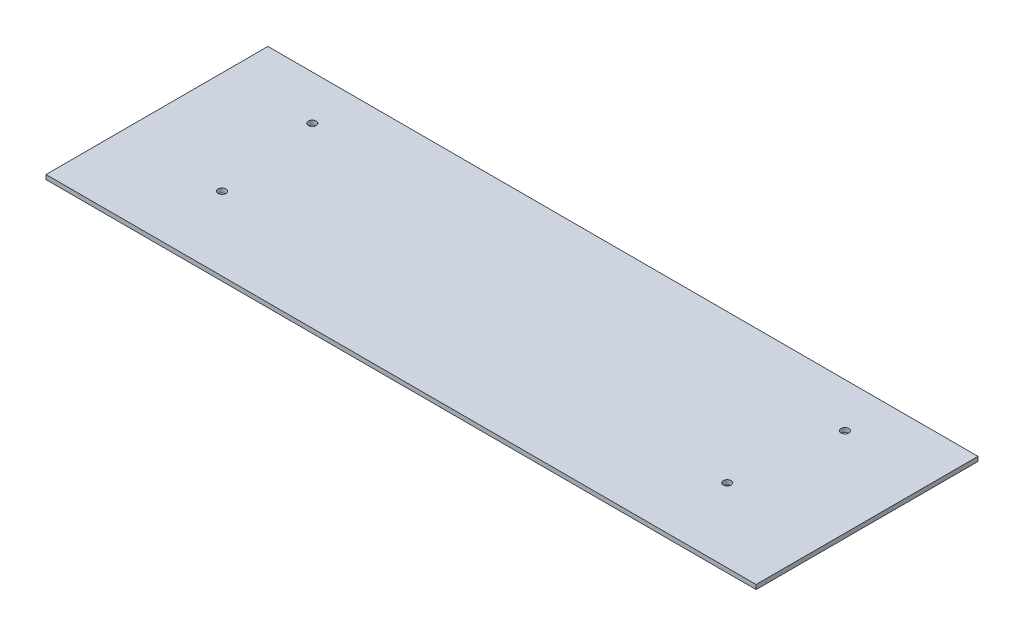
ISO-10303-21;
HEADER;
FILE_DESCRIPTION(('STEP AP214'),'2;1');
FILE_NAME('part.step','',(''),(''),'','','');
FILE_SCHEMA(('AUTOMOTIVE_DESIGN { 1 0 10303 214 1 1 1 1 }'));
ENDSEC;
DATA;
#1=APPLICATION_CONTEXT('core data for automotive mechanical design processes');
#2=APPLICATION_PROTOCOL_DEFINITION('international standard','automotive_design',2000,#1);
#3=PRODUCT_CONTEXT('',#1,'mechanical');
#4=PRODUCT('Part','Part','',(#3));
#5=PRODUCT_RELATED_PRODUCT_CATEGORY('part','',(#4));
#6=PRODUCT_DEFINITION_FORMATION('','',#4);
#7=PRODUCT_DEFINITION_CONTEXT('part definition',#1,'design');
#8=PRODUCT_DEFINITION('design','',#6,#7);
#9=PRODUCT_DEFINITION_SHAPE('','',#8);
#10=(LENGTH_UNIT() NAMED_UNIT(*) SI_UNIT(.MILLI.,.METRE.));
#11=(NAMED_UNIT(*) PLANE_ANGLE_UNIT() SI_UNIT($,.RADIAN.));
#12=(NAMED_UNIT(*) SI_UNIT($,.STERADIAN.) SOLID_ANGLE_UNIT());
#13=UNCERTAINTY_MEASURE_WITH_UNIT(LENGTH_MEASURE(1.E-05),#10,'distance_accuracy_value','');
#14=(GEOMETRIC_REPRESENTATION_CONTEXT(3) GLOBAL_UNCERTAINTY_ASSIGNED_CONTEXT((#13)) GLOBAL_UNIT_ASSIGNED_CONTEXT((#10,
#11,#12)) REPRESENTATION_CONTEXT('',''));
#15=CARTESIAN_POINT('',(0.,0.,0.));
#16=DIRECTION('',(0.,0.,1.));
#17=DIRECTION('',(1.,0.,0.));
#18=AXIS2_PLACEMENT_3D('',#15,#16,#17);
#19=CARTESIAN_POINT('',(-203.2,2.54,0.));
#20=DIRECTION('',(-1.,0.,0.));
#21=DIRECTION('',(0.,0.,1.));
#22=AXIS2_PLACEMENT_3D('',#19,#20,#21);
#23=PLANE('',#22);
#24=DIRECTION('',(0.,0.,-1.));
#25=VECTOR('',#24,1.);
#26=CARTESIAN_POINT('',(-203.2,0.,0.));
#27=LINE('',#26,#25);
#28=CARTESIAN_POINT('',(-203.2,0.,63.5));
#29=VERTEX_POINT('',#28);
#30=CARTESIAN_POINT('',(-203.2,0.,-63.5));
#31=VERTEX_POINT('',#30);
#32=EDGE_CURVE('E117',#29,#31,#27,.T.);
#33=ORIENTED_EDGE('',*,*,#32,.F.);
#34=DIRECTION('',(0.,-1.,0.));
#35=VECTOR('',#34,1.);
#36=CARTESIAN_POINT('',(-203.2,2.54,63.5));
#37=LINE('',#36,#35);
#38=CARTESIAN_POINT('',(-203.2,2.54,63.5));
#39=VERTEX_POINT('',#38);
#40=EDGE_CURVE('E11',#39,#29,#37,.T.);
#41=ORIENTED_EDGE('',*,*,#40,.F.);
#42=DIRECTION('',(0.,0.,-1.));
#43=VECTOR('',#42,1.);
#44=CARTESIAN_POINT('',(-203.2,2.54,0.));
#45=LINE('',#44,#43);
#46=CARTESIAN_POINT('',(-203.2,2.54,-63.5));
#47=VERTEX_POINT('',#46);
#48=EDGE_CURVE('E98',#39,#47,#45,.T.);
#49=ORIENTED_EDGE('',*,*,#48,.T.);
#50=DIRECTION('',(0.,-1.,0.));
#51=VECTOR('',#50,1.);
#52=CARTESIAN_POINT('',(-203.2,2.54,-63.5));
#53=LINE('',#52,#51);
#54=EDGE_CURVE('E77',#47,#31,#53,.T.);
#55=ORIENTED_EDGE('',*,*,#54,.T.);
#56=EDGE_LOOP('',(#33,#41,#49,#55));
#57=FACE_BOUND('',#56,.T.);
#58=ADVANCED_FACE('F37',(#57),#23,.T.);
#59=CARTESIAN_POINT('',(0.,2.54,63.5));
#60=DIRECTION('',(0.,0.,1.));
#61=DIRECTION('',(1.,0.,0.));
#62=AXIS2_PLACEMENT_3D('',#59,#60,#61);
#63=PLANE('',#62);
#64=DIRECTION('',(-1.,0.,0.));
#65=VECTOR('',#64,1.);
#66=CARTESIAN_POINT('',(0.,0.,63.5));
#67=LINE('',#66,#65);
#68=CARTESIAN_POINT('',(203.2,0.,63.5));
#69=VERTEX_POINT('',#68);
#70=EDGE_CURVE('E89',#69,#29,#67,.T.);
#71=ORIENTED_EDGE('',*,*,#70,.F.);
#72=DIRECTION('',(0.,-1.,0.));
#73=VECTOR('',#72,1.);
#74=CARTESIAN_POINT('',(203.2,2.54,63.5));
#75=LINE('',#74,#73);
#76=CARTESIAN_POINT('',(203.2,2.54,63.5));
#77=VERTEX_POINT('',#76);
#78=EDGE_CURVE('E46',#77,#69,#75,.T.);
#79=ORIENTED_EDGE('',*,*,#78,.F.);
#80=DIRECTION('',(-1.,0.,0.));
#81=VECTOR('',#80,1.);
#82=CARTESIAN_POINT('',(0.,2.54,63.5));
#83=LINE('',#82,#81);
#84=EDGE_CURVE('E87',#77,#39,#83,.T.);
#85=ORIENTED_EDGE('',*,*,#84,.T.);
#86=ORIENTED_EDGE('',*,*,#40,.T.);
#87=EDGE_LOOP('',(#71,#79,#85,#86));
#88=FACE_BOUND('',#87,.T.);
#89=ADVANCED_FACE('F85',(#88),#63,.T.);
#90=CARTESIAN_POINT('',(203.2,2.54,0.));
#91=DIRECTION('',(-1.,0.,0.));
#92=DIRECTION('',(0.,0.,1.));
#93=AXIS2_PLACEMENT_3D('',#90,#91,#92);
#94=PLANE('',#93);
#95=DIRECTION('',(0.,0.,-1.));
#96=VECTOR('',#95,1.);
#97=CARTESIAN_POINT('',(203.2,0.,0.));
#98=LINE('',#97,#96);
#99=CARTESIAN_POINT('',(203.2,0.,-63.5));
#100=VERTEX_POINT('',#99);
#101=EDGE_CURVE('E120',#69,#100,#98,.T.);
#102=ORIENTED_EDGE('',*,*,#101,.T.);
#103=DIRECTION('',(0.,-1.,0.));
#104=VECTOR('',#103,1.);
#105=CARTESIAN_POINT('',(203.2,2.54,-63.5));
#106=LINE('',#105,#104);
#107=CARTESIAN_POINT('',(203.2,2.54,-63.5));
#108=VERTEX_POINT('',#107);
#109=EDGE_CURVE('E92',#108,#100,#106,.T.);
#110=ORIENTED_EDGE('',*,*,#109,.F.);
#111=DIRECTION('',(0.,0.,-1.));
#112=VECTOR('',#111,1.);
#113=CARTESIAN_POINT('',(203.2,2.54,0.));
#114=LINE('',#113,#112);
#115=EDGE_CURVE('E94',#77,#108,#114,.T.);
#116=ORIENTED_EDGE('',*,*,#115,.F.);
#117=ORIENTED_EDGE('',*,*,#78,.T.);
#118=EDGE_LOOP('',(#102,#110,#116,#117));
#119=FACE_BOUND('',#118,.T.);
#120=ADVANCED_FACE('F95',(#119),#94,.F.);
#121=CARTESIAN_POINT('',(152.4,2.54,-38.1));
#122=DIRECTION('',(0.,-1.,0.));
#123=DIRECTION('',(0.,0.,-1.));
#124=AXIS2_PLACEMENT_3D('',#121,#122,#123);
#125=CYLINDRICAL_SURFACE('',#124,2.25000000000001);
#126=CARTESIAN_POINT('',(152.4,2.54,-38.1));
#127=DIRECTION('',(0.,1.,0.));
#128=DIRECTION('',(0.,0.,1.));
#129=AXIS2_PLACEMENT_3D('',#126,#127,#128);
#130=CIRCLE('',#129,2.25000000000001);
#131=CARTESIAN_POINT('',(152.4,2.54,-35.85));
#132=VERTEX_POINT('',#131);
#133=EDGE_CURVE('E100',#132,#132,#130,.T.);
#134=ORIENTED_EDGE('',*,*,#133,.T.);
#135=EDGE_LOOP('',(#134));
#136=FACE_BOUND('',#135,.T.);
#137=CARTESIAN_POINT('',(152.4,0.,-38.1));
#138=DIRECTION('',(0.,1.,0.));
#139=DIRECTION('',(0.,0.,1.));
#140=AXIS2_PLACEMENT_3D('',#137,#138,#139);
#141=CIRCLE('',#140,2.25000000000001);
#142=CARTESIAN_POINT('',(152.4,0.,-35.85));
#143=VERTEX_POINT('',#142);
#144=EDGE_CURVE('E114',#143,#143,#141,.T.);
#145=ORIENTED_EDGE('',*,*,#144,.F.);
#146=EDGE_LOOP('',(#145));
#147=FACE_BOUND('',#146,.T.);
#148=ADVANCED_FACE('F136',(#136,#147),#125,.F.);
#149=CARTESIAN_POINT('',(144.568428466797,2.54,21.3866916824286));
#150=DIRECTION('',(0.,-1.,0.));
#151=DIRECTION('',(0.,0.,-1.));
#152=AXIS2_PLACEMENT_3D('',#149,#150,#151);
#153=CYLINDRICAL_SURFACE('',#152,2.25000000000001);
#154=CARTESIAN_POINT('',(144.568428466797,2.54,21.3866916824286));
#155=DIRECTION('',(0.,1.,0.));
#156=DIRECTION('',(0.,0.,1.));
#157=AXIS2_PLACEMENT_3D('',#154,#155,#156);
#158=CIRCLE('',#157,2.25000000000001);
#159=CARTESIAN_POINT('',(144.568428466797,2.54,23.6366916824286));
#160=VERTEX_POINT('',#159);
#161=EDGE_CURVE('E236',#160,#160,#158,.T.);
#162=ORIENTED_EDGE('',*,*,#161,.T.);
#163=EDGE_LOOP('',(#162));
#164=FACE_BOUND('',#163,.T.);
#165=CARTESIAN_POINT('',(144.568428466797,0.,21.3866916824286));
#166=DIRECTION('',(0.,1.,0.));
#167=DIRECTION('',(0.,0.,1.));
#168=AXIS2_PLACEMENT_3D('',#165,#166,#167);
#169=CIRCLE('',#168,2.25000000000001);
#170=CARTESIAN_POINT('',(144.568428466797,0.,23.6366916824286));
#171=VERTEX_POINT('',#170);
#172=EDGE_CURVE('E111',#171,#171,#169,.T.);
#173=ORIENTED_EDGE('',*,*,#172,.F.);
#174=EDGE_LOOP('',(#173));
#175=FACE_BOUND('',#174,.T.);
#176=ADVANCED_FACE('F139',(#164,#175),#153,.F.);
#177=CARTESIAN_POINT('',(-144.568428466797,2.54,21.3866916824286));
#178=DIRECTION('',(0.,-1.,0.));
#179=DIRECTION('',(0.,0.,-1.));
#180=AXIS2_PLACEMENT_3D('',#177,#178,#179);
#181=CYLINDRICAL_SURFACE('',#180,2.25000000000001);
#182=CARTESIAN_POINT('',(-144.568428466797,2.54,21.3866916824286));
#183=DIRECTION('',(0.,1.,0.));
#184=DIRECTION('',(0.,0.,1.));
#185=AXIS2_PLACEMENT_3D('',#182,#183,#184);
#186=CIRCLE('',#185,2.25000000000001);
#187=CARTESIAN_POINT('',(-144.568428466797,2.54,23.6366916824286));
#188=VERTEX_POINT('',#187);
#189=EDGE_CURVE('E153',#188,#188,#186,.T.);
#190=ORIENTED_EDGE('',*,*,#189,.T.);
#191=EDGE_LOOP('',(#190));
#192=FACE_BOUND('',#191,.T.);
#193=CARTESIAN_POINT('',(-144.568428466797,0.,21.3866916824286));
#194=DIRECTION('',(0.,1.,0.));
#195=DIRECTION('',(0.,0.,1.));
#196=AXIS2_PLACEMENT_3D('',#193,#194,#195);
#197=CIRCLE('',#196,2.25000000000001);
#198=CARTESIAN_POINT('',(-144.568428466797,0.,23.6366916824286));
#199=VERTEX_POINT('',#198);
#200=EDGE_CURVE('E108',#199,#199,#197,.T.);
#201=ORIENTED_EDGE('',*,*,#200,.F.);
#202=EDGE_LOOP('',(#201));
#203=FACE_BOUND('',#202,.T.);
#204=ADVANCED_FACE('F142',(#192,#203),#181,.F.);
#205=CARTESIAN_POINT('',(-152.4,2.54,-38.1));
#206=DIRECTION('',(0.,-1.,0.));
#207=DIRECTION('',(0.,0.,-1.));
#208=AXIS2_PLACEMENT_3D('',#205,#206,#207);
#209=CYLINDRICAL_SURFACE('',#208,2.25000000000001);
#210=CARTESIAN_POINT('',(-152.4,2.54,-38.1));
#211=DIRECTION('',(0.,1.,0.));
#212=DIRECTION('',(0.,0.,1.));
#213=AXIS2_PLACEMENT_3D('',#210,#211,#212);
#214=CIRCLE('',#213,2.25000000000001);
#215=CARTESIAN_POINT('',(-152.4,2.54,-35.85));
#216=VERTEX_POINT('',#215);
#217=EDGE_CURVE('E123',#216,#216,#214,.T.);
#218=ORIENTED_EDGE('',*,*,#217,.T.);
#219=EDGE_LOOP('',(#218));
#220=FACE_BOUND('',#219,.T.);
#221=CARTESIAN_POINT('',(-152.4,0.,-38.1));
#222=DIRECTION('',(0.,1.,0.));
#223=DIRECTION('',(0.,0.,1.));
#224=AXIS2_PLACEMENT_3D('',#221,#222,#223);
#225=CIRCLE('',#224,2.25000000000001);
#226=CARTESIAN_POINT('',(-152.4,0.,-35.85));
#227=VERTEX_POINT('',#226);
#228=EDGE_CURVE('E105',#227,#227,#225,.T.);
#229=ORIENTED_EDGE('',*,*,#228,.F.);
#230=EDGE_LOOP('',(#229));
#231=FACE_BOUND('',#230,.T.);
#232=ADVANCED_FACE('F39',(#220,#231),#209,.F.);
#233=CARTESIAN_POINT('',(0.,2.54,-63.5));
#234=DIRECTION('',(0.,0.,1.));
#235=DIRECTION('',(1.,0.,0.));
#236=AXIS2_PLACEMENT_3D('',#233,#234,#235);
#237=PLANE('',#236);
#238=DIRECTION('',(-1.,0.,0.));
#239=VECTOR('',#238,1.);
#240=CARTESIAN_POINT('',(0.,0.,-63.5));
#241=LINE('',#240,#239);
#242=EDGE_CURVE('E70',#100,#31,#241,.T.);
#243=ORIENTED_EDGE('',*,*,#242,.T.);
#244=ORIENTED_EDGE('',*,*,#54,.F.);
#245=DIRECTION('',(-1.,0.,0.));
#246=VECTOR('',#245,1.);
#247=CARTESIAN_POINT('',(0.,2.54,-63.5));
#248=LINE('',#247,#246);
#249=EDGE_CURVE('E54',#108,#47,#248,.T.);
#250=ORIENTED_EDGE('',*,*,#249,.F.);
#251=ORIENTED_EDGE('',*,*,#109,.T.);
#252=EDGE_LOOP('',(#243,#244,#250,#251));
#253=FACE_BOUND('',#252,.T.);
#254=ADVANCED_FACE('F126',(#253),#237,.F.);
#255=CARTESIAN_POINT('',(0.,2.54,0.));
#256=DIRECTION('',(0.,1.,0.));
#257=DIRECTION('',(0.,0.,1.));
#258=AXIS2_PLACEMENT_3D('',#255,#256,#257);
#259=PLANE('',#258);
#260=ORIENTED_EDGE('',*,*,#217,.F.);
#261=EDGE_LOOP('',(#260));
#262=FACE_BOUND('',#261,.T.);
#263=ORIENTED_EDGE('',*,*,#189,.F.);
#264=EDGE_LOOP('',(#263));
#265=FACE_BOUND('',#264,.T.);
#266=ORIENTED_EDGE('',*,*,#161,.F.);
#267=EDGE_LOOP('',(#266));
#268=FACE_BOUND('',#267,.T.);
#269=ORIENTED_EDGE('',*,*,#133,.F.);
#270=EDGE_LOOP('',(#269));
#271=FACE_BOUND('',#270,.T.);
#272=ORIENTED_EDGE('',*,*,#48,.F.);
#273=ORIENTED_EDGE('',*,*,#84,.F.);
#274=ORIENTED_EDGE('',*,*,#115,.T.);
#275=ORIENTED_EDGE('',*,*,#249,.T.);
#276=EDGE_LOOP('',(#272,#273,#274,#275));
#277=FACE_BOUND('',#276,.T.);
#278=ADVANCED_FACE('F97',(#262,#265,#268,#271,#277),#259,.T.);
#279=CARTESIAN_POINT('',(0.,0.,0.));
#280=DIRECTION('',(0.,1.,0.));
#281=DIRECTION('',(0.,0.,1.));
#282=AXIS2_PLACEMENT_3D('',#279,#280,#281);
#283=PLANE('',#282);
#284=ORIENTED_EDGE('',*,*,#228,.T.);
#285=EDGE_LOOP('',(#284));
#286=FACE_BOUND('',#285,.T.);
#287=ORIENTED_EDGE('',*,*,#200,.T.);
#288=EDGE_LOOP('',(#287));
#289=FACE_BOUND('',#288,.T.);
#290=ORIENTED_EDGE('',*,*,#172,.T.);
#291=EDGE_LOOP('',(#290));
#292=FACE_BOUND('',#291,.T.);
#293=ORIENTED_EDGE('',*,*,#144,.T.);
#294=EDGE_LOOP('',(#293));
#295=FACE_BOUND('',#294,.T.);
#296=ORIENTED_EDGE('',*,*,#32,.T.);
#297=ORIENTED_EDGE('',*,*,#242,.F.);
#298=ORIENTED_EDGE('',*,*,#101,.F.);
#299=ORIENTED_EDGE('',*,*,#70,.T.);
#300=EDGE_LOOP('',(#296,#297,#298,#299));
#301=FACE_BOUND('',#300,.T.);
#302=ADVANCED_FACE('F127',(#286,#289,#292,#295,#301),#283,.F.);
#303=CLOSED_SHELL('',(#58,#89,#120,#148,#176,#204,#232,#254,#278,#302));
#304=MANIFOLD_SOLID_BREP('B2',#303);
#305=ADVANCED_BREP_SHAPE_REPRESENTATION('',(#18,#304),#14);
#306=SHAPE_DEFINITION_REPRESENTATION(#9,#305);
ENDSEC;
END-ISO-10303-21;
